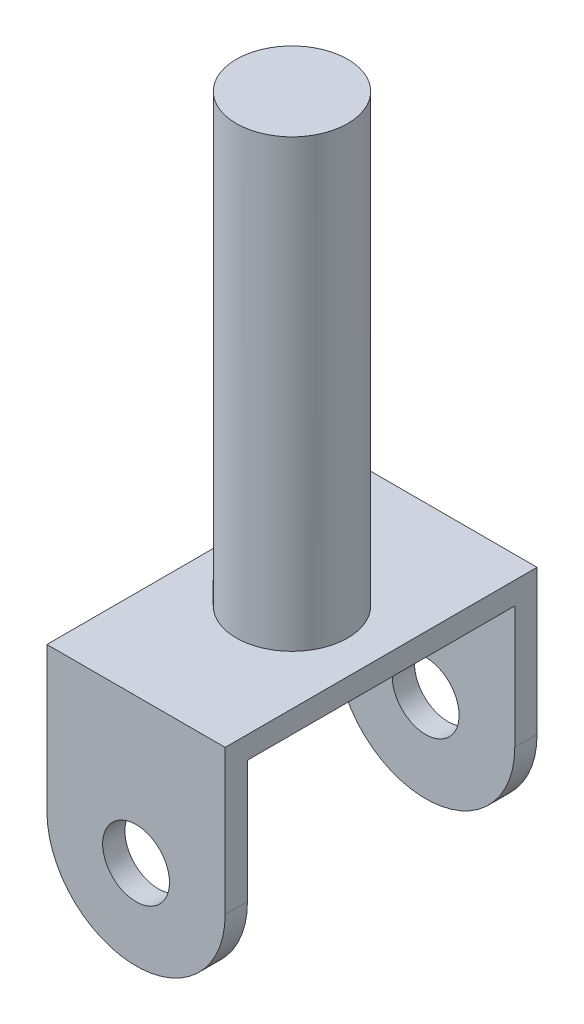
ISO-10303-21;
HEADER;
FILE_DESCRIPTION(('STEP AP214'),'2;1');
FILE_NAME('part.step','',(''),(''),'','','');
FILE_SCHEMA(('AUTOMOTIVE_DESIGN { 1 0 10303 214 1 1 1 1 }'));
ENDSEC;
DATA;
#1=APPLICATION_CONTEXT('core data for automotive mechanical design processes');
#2=APPLICATION_PROTOCOL_DEFINITION('international standard','automotive_design',2000,#1);
#3=PRODUCT_CONTEXT('',#1,'mechanical');
#4=PRODUCT('Part','Part','',(#3));
#5=PRODUCT_RELATED_PRODUCT_CATEGORY('part','',(#4));
#6=PRODUCT_DEFINITION_FORMATION('','',#4);
#7=PRODUCT_DEFINITION_CONTEXT('part definition',#1,'design');
#8=PRODUCT_DEFINITION('design','',#6,#7);
#9=PRODUCT_DEFINITION_SHAPE('','',#8);
#10=(LENGTH_UNIT() NAMED_UNIT(*) SI_UNIT(.MILLI.,.METRE.));
#11=(NAMED_UNIT(*) PLANE_ANGLE_UNIT() SI_UNIT($,.RADIAN.));
#12=(NAMED_UNIT(*) SI_UNIT($,.STERADIAN.) SOLID_ANGLE_UNIT());
#13=UNCERTAINTY_MEASURE_WITH_UNIT(LENGTH_MEASURE(1.E-05),#10,'distance_accuracy_value','');
#14=(GEOMETRIC_REPRESENTATION_CONTEXT(3) GLOBAL_UNCERTAINTY_ASSIGNED_CONTEXT((#13)) GLOBAL_UNIT_ASSIGNED_CONTEXT((#10,
#11,#12)) REPRESENTATION_CONTEXT('',''));
#15=CARTESIAN_POINT('',(0.,0.,0.));
#16=DIRECTION('',(0.,0.,1.));
#17=DIRECTION('',(1.,0.,0.));
#18=AXIS2_PLACEMENT_3D('',#15,#16,#17);
#19=CARTESIAN_POINT('',(4.,3.5,14.));
#20=DIRECTION('',(0.,0.,-1.));
#21=DIRECTION('',(-1.,0.,0.));
#22=AXIS2_PLACEMENT_3D('',#19,#20,#21);
#23=CYLINDRICAL_SURFACE('',#22,4.);
#24=DIRECTION('',(0.,0.,-1.));
#25=VECTOR('',#24,1.);
#26=CARTESIAN_POINT('',(8.,3.5,14.));
#27=LINE('',#26,#25);
#28=CARTESIAN_POINT('',(8.,3.5,1.));
#29=VERTEX_POINT('',#28);
#30=CARTESIAN_POINT('',(8.,3.5,0.));
#31=VERTEX_POINT('',#30);
#32=EDGE_CURVE('E175',#29,#31,#27,.T.);
#33=ORIENTED_EDGE('',*,*,#32,.F.);
#34=CARTESIAN_POINT('',(4.,3.5,1.));
#35=DIRECTION('',(0.,0.,-1.));
#36=DIRECTION('',(-1.,0.,0.));
#37=AXIS2_PLACEMENT_3D('',#34,#35,#36);
#38=CIRCLE('',#37,4.);
#39=CARTESIAN_POINT('',(0.,3.5,1.));
#40=VERTEX_POINT('',#39);
#41=EDGE_CURVE('E141',#29,#40,#38,.T.);
#42=ORIENTED_EDGE('',*,*,#41,.T.);
#43=DIRECTION('',(0.,0.,-1.));
#44=VECTOR('',#43,1.);
#45=CARTESIAN_POINT('',(0.,3.5,14.));
#46=LINE('',#45,#44);
#47=CARTESIAN_POINT('',(0.,3.5,0.));
#48=VERTEX_POINT('',#47);
#49=EDGE_CURVE('E81',#40,#48,#46,.T.);
#50=ORIENTED_EDGE('',*,*,#49,.T.);
#51=CARTESIAN_POINT('',(4.,3.5,0.));
#52=DIRECTION('',(0.,0.,1.));
#53=DIRECTION('',(1.,0.,0.));
#54=AXIS2_PLACEMENT_3D('',#51,#52,#53);
#55=CIRCLE('',#54,4.);
#56=EDGE_CURVE('E151',#48,#31,#55,.T.);
#57=ORIENTED_EDGE('',*,*,#56,.T.);
#58=EDGE_LOOP('',(#33,#42,#50,#57));
#59=FACE_BOUND('',#58,.T.);
#60=ADVANCED_FACE('F33',(#59),#23,.T.);
#61=CARTESIAN_POINT('',(4.,3.5,14.));
#62=DIRECTION('',(0.,0.,-1.));
#63=DIRECTION('',(-1.,0.,0.));
#64=AXIS2_PLACEMENT_3D('',#61,#62,#63);
#65=CYLINDRICAL_SURFACE('',#64,1.5);
#66=CARTESIAN_POINT('',(4.,3.5,1.));
#67=DIRECTION('',(0.,0.,-1.));
#68=DIRECTION('',(-1.,0.,0.));
#69=AXIS2_PLACEMENT_3D('',#66,#67,#68);
#70=CIRCLE('',#69,1.5);
#71=CARTESIAN_POINT('',(2.5,3.5,1.));
#72=VERTEX_POINT('',#71);
#73=EDGE_CURVE('E37',#72,#72,#70,.T.);
#74=ORIENTED_EDGE('',*,*,#73,.F.);
#75=EDGE_LOOP('',(#74));
#76=FACE_BOUND('',#75,.T.);
#77=CARTESIAN_POINT('',(4.,3.5,0.));
#78=DIRECTION('',(0.,0.,1.));
#79=DIRECTION('',(1.,0.,0.));
#80=AXIS2_PLACEMENT_3D('',#77,#78,#79);
#81=CIRCLE('',#80,1.5);
#82=CARTESIAN_POINT('',(5.5,3.5,0.));
#83=VERTEX_POINT('',#82);
#84=EDGE_CURVE('E147',#83,#83,#81,.T.);
#85=ORIENTED_EDGE('',*,*,#84,.F.);
#86=EDGE_LOOP('',(#85));
#87=FACE_BOUND('',#86,.T.);
#88=ADVANCED_FACE('F185',(#76,#87),#65,.F.);
#89=CARTESIAN_POINT('',(0.,10.,14.));
#90=DIRECTION('',(0.,-1.,0.));
#91=DIRECTION('',(0.,0.,-1.));
#92=AXIS2_PLACEMENT_3D('',#89,#90,#91);
#93=PLANE('',#92);
#94=DIRECTION('',(-1.,0.,0.));
#95=VECTOR('',#94,1.);
#96=CARTESIAN_POINT('',(0.,10.,0.));
#97=LINE('',#96,#95);
#98=CARTESIAN_POINT('',(8.,10.,0.));
#99=VERTEX_POINT('',#98);
#100=CARTESIAN_POINT('',(0.,10.,0.));
#101=VERTEX_POINT('',#100);
#102=EDGE_CURVE('E164',#99,#101,#97,.T.);
#103=ORIENTED_EDGE('',*,*,#102,.T.);
#104=DIRECTION('',(0.,0.,-1.));
#105=VECTOR('',#104,1.);
#106=CARTESIAN_POINT('',(0.,10.,14.));
#107=LINE('',#106,#105);
#108=CARTESIAN_POINT('',(0.,10.,14.));
#109=VERTEX_POINT('',#108);
#110=EDGE_CURVE('E169',#109,#101,#107,.T.);
#111=ORIENTED_EDGE('',*,*,#110,.F.);
#112=DIRECTION('',(-1.,0.,0.));
#113=VECTOR('',#112,1.);
#114=CARTESIAN_POINT('',(0.,10.,14.));
#115=LINE('',#114,#113);
#116=CARTESIAN_POINT('',(8.,10.,14.));
#117=VERTEX_POINT('',#116);
#118=EDGE_CURVE('E158',#117,#109,#115,.T.);
#119=ORIENTED_EDGE('',*,*,#118,.F.);
#120=DIRECTION('',(0.,0.,-1.));
#121=VECTOR('',#120,1.);
#122=CARTESIAN_POINT('',(8.,10.,14.));
#123=LINE('',#122,#121);
#124=EDGE_CURVE('E172',#117,#99,#123,.T.);
#125=ORIENTED_EDGE('',*,*,#124,.T.);
#126=EDGE_LOOP('',(#103,#111,#119,#125));
#127=FACE_BOUND('',#126,.T.);
#128=CARTESIAN_POINT('',(4.,10.,7.));
#129=DIRECTION('',(0.,-1.,0.));
#130=DIRECTION('',(0.,0.,-1.));
#131=AXIS2_PLACEMENT_3D('',#128,#129,#130);
#132=CIRCLE('',#131,2.5);
#133=CARTESIAN_POINT('',(4.,10.,4.5));
#134=VERTEX_POINT('',#133);
#135=EDGE_CURVE('E11',#134,#134,#132,.F.);
#136=ORIENTED_EDGE('',*,*,#135,.F.);
#137=EDGE_LOOP('',(#136));
#138=FACE_BOUND('',#137,.T.);
#139=ADVANCED_FACE('F191',(#127,#138),#93,.F.);
#140=CARTESIAN_POINT('',(4.,3.5,14.));
#141=DIRECTION('',(0.,0.,1.));
#142=DIRECTION('',(1.,0.,0.));
#143=AXIS2_PLACEMENT_3D('',#140,#141,#142);
#144=PLANE('',#143);
#145=CARTESIAN_POINT('',(4.,3.5,14.));
#146=DIRECTION('',(0.,0.,1.));
#147=DIRECTION('',(1.,0.,0.));
#148=AXIS2_PLACEMENT_3D('',#145,#146,#147);
#149=CIRCLE('',#148,4.);
#150=CARTESIAN_POINT('',(0.,3.5,14.));
#151=VERTEX_POINT('',#150);
#152=CARTESIAN_POINT('',(8.,3.5,14.));
#153=VERTEX_POINT('',#152);
#154=EDGE_CURVE('E154',#151,#153,#149,.T.);
#155=ORIENTED_EDGE('',*,*,#154,.T.);
#156=DIRECTION('',(0.,1.,0.));
#157=VECTOR('',#156,1.);
#158=CARTESIAN_POINT('',(8.,10.,14.));
#159=LINE('',#158,#157);
#160=EDGE_CURVE('E89',#153,#117,#159,.T.);
#161=ORIENTED_EDGE('',*,*,#160,.T.);
#162=ORIENTED_EDGE('',*,*,#118,.T.);
#163=DIRECTION('',(0.,-1.,0.));
#164=VECTOR('',#163,1.);
#165=CARTESIAN_POINT('',(0.,3.5,14.));
#166=LINE('',#165,#164);
#167=EDGE_CURVE('E59',#109,#151,#166,.T.);
#168=ORIENTED_EDGE('',*,*,#167,.T.);
#169=EDGE_LOOP('',(#155,#161,#162,#168));
#170=FACE_BOUND('',#169,.T.);
#171=CARTESIAN_POINT('',(4.,3.5,14.));
#172=DIRECTION('',(0.,0.,1.));
#173=DIRECTION('',(1.,0.,0.));
#174=AXIS2_PLACEMENT_3D('',#171,#172,#173);
#175=CIRCLE('',#174,1.5);
#176=CARTESIAN_POINT('',(5.5,3.5,14.));
#177=VERTEX_POINT('',#176);
#178=EDGE_CURVE('E148',#177,#177,#175,.T.);
#179=ORIENTED_EDGE('',*,*,#178,.F.);
#180=EDGE_LOOP('',(#179));
#181=FACE_BOUND('',#180,.T.);
#182=ADVANCED_FACE('F188',(#170,#181),#144,.T.);
#183=CARTESIAN_POINT('',(4.,3.5,0.));
#184=DIRECTION('',(0.,0.,1.));
#185=DIRECTION('',(1.,0.,0.));
#186=AXIS2_PLACEMENT_3D('',#183,#184,#185);
#187=PLANE('',#186);
#188=ORIENTED_EDGE('',*,*,#56,.F.);
#189=DIRECTION('',(0.,-1.,0.));
#190=VECTOR('',#189,1.);
#191=CARTESIAN_POINT('',(0.,3.5,0.));
#192=LINE('',#191,#190);
#193=EDGE_CURVE('E156',#101,#48,#192,.T.);
#194=ORIENTED_EDGE('',*,*,#193,.F.);
#195=ORIENTED_EDGE('',*,*,#102,.F.);
#196=DIRECTION('',(0.,1.,0.));
#197=VECTOR('',#196,1.);
#198=CARTESIAN_POINT('',(8.,10.,0.));
#199=LINE('',#198,#197);
#200=EDGE_CURVE('E162',#31,#99,#199,.T.);
#201=ORIENTED_EDGE('',*,*,#200,.F.);
#202=EDGE_LOOP('',(#188,#194,#195,#201));
#203=FACE_BOUND('',#202,.T.);
#204=ORIENTED_EDGE('',*,*,#84,.T.);
#205=EDGE_LOOP('',(#204));
#206=FACE_BOUND('',#205,.T.);
#207=ADVANCED_FACE('F190',(#203,#206),#187,.F.);
#208=CARTESIAN_POINT('',(0.,3.5,13.));
#209=VERTEX_POINT('',#208);
#210=EDGE_CURVE('E167',#151,#209,#46,.T.);
#211=ORIENTED_EDGE('',*,*,#210,.T.);
#212=CARTESIAN_POINT('',(4.,3.5,13.));
#213=DIRECTION('',(0.,0.,1.));
#214=DIRECTION('',(1.,0.,0.));
#215=AXIS2_PLACEMENT_3D('',#212,#213,#214);
#216=CIRCLE('',#215,4.);
#217=CARTESIAN_POINT('',(8.,3.5,13.));
#218=VERTEX_POINT('',#217);
#219=EDGE_CURVE('E50',#209,#218,#216,.T.);
#220=ORIENTED_EDGE('',*,*,#219,.T.);
#221=EDGE_CURVE('E42',#153,#218,#27,.T.);
#222=ORIENTED_EDGE('',*,*,#221,.F.);
#223=ORIENTED_EDGE('',*,*,#154,.F.);
#224=EDGE_LOOP('',(#211,#220,#222,#223));
#225=FACE_BOUND('',#224,.T.);
#226=ADVANCED_FACE('F35',(#225),#23,.T.);
#227=CARTESIAN_POINT('',(8.,10.,14.));
#228=DIRECTION('',(-1.,0.,0.));
#229=DIRECTION('',(0.,0.,1.));
#230=AXIS2_PLACEMENT_3D('',#227,#228,#229);
#231=PLANE('',#230);
#232=DIRECTION('',(0.,0.,-1.));
#233=VECTOR('',#232,1.);
#234=CARTESIAN_POINT('',(8.,9.,14.));
#235=LINE('',#234,#233);
#236=CARTESIAN_POINT('',(8.,9.,13.));
#237=VERTEX_POINT('',#236);
#238=CARTESIAN_POINT('',(8.,9.,1.));
#239=VERTEX_POINT('',#238);
#240=EDGE_CURVE('E119',#237,#239,#235,.T.);
#241=ORIENTED_EDGE('',*,*,#240,.T.);
#242=DIRECTION('',(0.,-1.,0.));
#243=VECTOR('',#242,1.);
#244=CARTESIAN_POINT('',(8.,10.,1.));
#245=LINE('',#244,#243);
#246=EDGE_CURVE('E138',#239,#29,#245,.T.);
#247=ORIENTED_EDGE('',*,*,#246,.T.);
#248=ORIENTED_EDGE('',*,*,#32,.T.);
#249=ORIENTED_EDGE('',*,*,#200,.T.);
#250=ORIENTED_EDGE('',*,*,#124,.F.);
#251=ORIENTED_EDGE('',*,*,#160,.F.);
#252=ORIENTED_EDGE('',*,*,#221,.T.);
#253=DIRECTION('',(0.,1.,0.));
#254=VECTOR('',#253,1.);
#255=CARTESIAN_POINT('',(8.,10.,13.));
#256=LINE('',#255,#254);
#257=EDGE_CURVE('E135',#218,#237,#256,.T.);
#258=ORIENTED_EDGE('',*,*,#257,.T.);
#259=EDGE_LOOP('',(#241,#247,#248,#249,#250,#251,#252,#258));
#260=FACE_BOUND('',#259,.T.);
#261=ADVANCED_FACE('F208',(#260),#231,.F.);
#262=CARTESIAN_POINT('',(0.,3.5,14.));
#263=DIRECTION('',(1.,0.,0.));
#264=DIRECTION('',(0.,0.,-1.));
#265=AXIS2_PLACEMENT_3D('',#262,#263,#264);
#266=PLANE('',#265);
#267=ORIENTED_EDGE('',*,*,#49,.F.);
#268=DIRECTION('',(0.,-1.,0.));
#269=VECTOR('',#268,1.);
#270=CARTESIAN_POINT('',(0.,9.,1.));
#271=LINE('',#270,#269);
#272=CARTESIAN_POINT('',(0.,9.,1.));
#273=VERTEX_POINT('',#272);
#274=EDGE_CURVE('E127',#273,#40,#271,.T.);
#275=ORIENTED_EDGE('',*,*,#274,.F.);
#276=DIRECTION('',(0.,0.,-1.));
#277=VECTOR('',#276,1.);
#278=CARTESIAN_POINT('',(0.,9.,1.));
#279=LINE('',#278,#277);
#280=CARTESIAN_POINT('',(0.,9.,13.));
#281=VERTEX_POINT('',#280);
#282=EDGE_CURVE('E116',#281,#273,#279,.T.);
#283=ORIENTED_EDGE('',*,*,#282,.F.);
#284=DIRECTION('',(0.,1.,0.));
#285=VECTOR('',#284,1.);
#286=CARTESIAN_POINT('',(0.,9.,13.));
#287=LINE('',#286,#285);
#288=EDGE_CURVE('E123',#209,#281,#287,.T.);
#289=ORIENTED_EDGE('',*,*,#288,.F.);
#290=ORIENTED_EDGE('',*,*,#210,.F.);
#291=ORIENTED_EDGE('',*,*,#167,.F.);
#292=ORIENTED_EDGE('',*,*,#110,.T.);
#293=ORIENTED_EDGE('',*,*,#193,.T.);
#294=EDGE_LOOP('',(#267,#275,#283,#289,#290,#291,#292,#293));
#295=FACE_BOUND('',#294,.T.);
#296=ADVANCED_FACE('F129',(#295),#266,.F.);
#297=CARTESIAN_POINT('',(4.,3.5,13.));
#298=DIRECTION('',(0.,0.,1.));
#299=DIRECTION('',(1.,0.,0.));
#300=AXIS2_PLACEMENT_3D('',#297,#298,#299);
#301=CIRCLE('',#300,1.5);
#302=CARTESIAN_POINT('',(5.5,3.5,13.));
#303=VERTEX_POINT('',#302);
#304=EDGE_CURVE('E133',#303,#303,#301,.T.);
#305=ORIENTED_EDGE('',*,*,#304,.F.);
#306=EDGE_LOOP('',(#305));
#307=FACE_BOUND('',#306,.T.);
#308=ORIENTED_EDGE('',*,*,#178,.T.);
#309=EDGE_LOOP('',(#308));
#310=FACE_BOUND('',#309,.T.);
#311=ADVANCED_FACE('F180',(#307,#310),#65,.F.);
#312=CARTESIAN_POINT('',(4.,30.,7.));
#313=DIRECTION('',(0.,-1.,0.));
#314=DIRECTION('',(0.,0.,-1.));
#315=AXIS2_PLACEMENT_3D('',#312,#313,#314);
#316=CYLINDRICAL_SURFACE('',#315,2.5);
#317=CARTESIAN_POINT('',(4.,30.,7.));
#318=DIRECTION('',(0.,1.,0.));
#319=DIRECTION('',(0.,0.,1.));
#320=AXIS2_PLACEMENT_3D('',#317,#318,#319);
#321=CIRCLE('',#320,2.5);
#322=CARTESIAN_POINT('',(4.,30.,9.5));
#323=VERTEX_POINT('',#322);
#324=EDGE_CURVE('E144',#323,#323,#321,.T.);
#325=ORIENTED_EDGE('',*,*,#324,.F.);
#326=EDGE_LOOP('',(#325));
#327=FACE_BOUND('',#326,.T.);
#328=ORIENTED_EDGE('',*,*,#135,.T.);
#329=EDGE_LOOP('',(#328));
#330=FACE_BOUND('',#329,.T.);
#331=ADVANCED_FACE('F183',(#327,#330),#316,.T.);
#332=CARTESIAN_POINT('',(4.,30.,7.));
#333=DIRECTION('',(0.,1.,0.));
#334=DIRECTION('',(0.,0.,1.));
#335=AXIS2_PLACEMENT_3D('',#332,#333,#334);
#336=PLANE('',#335);
#337=ORIENTED_EDGE('',*,*,#324,.T.);
#338=EDGE_LOOP('',(#337));
#339=FACE_BOUND('',#338,.T.);
#340=ADVANCED_FACE('F232',(#339),#336,.T.);
#341=CARTESIAN_POINT('',(20.,9.,1.));
#342=DIRECTION('',(0.,1.,0.));
#343=DIRECTION('',(0.,0.,1.));
#344=AXIS2_PLACEMENT_3D('',#341,#342,#343);
#345=PLANE('',#344);
#346=DIRECTION('',(-1.,0.,0.));
#347=VECTOR('',#346,1.);
#348=CARTESIAN_POINT('',(20.,9.,13.));
#349=LINE('',#348,#347);
#350=EDGE_CURVE('E112',#237,#281,#349,.T.);
#351=ORIENTED_EDGE('',*,*,#350,.T.);
#352=ORIENTED_EDGE('',*,*,#282,.T.);
#353=DIRECTION('',(-1.,0.,0.));
#354=VECTOR('',#353,1.);
#355=CARTESIAN_POINT('',(20.,9.,1.));
#356=LINE('',#355,#354);
#357=EDGE_CURVE('E121',#239,#273,#356,.T.);
#358=ORIENTED_EDGE('',*,*,#357,.F.);
#359=ORIENTED_EDGE('',*,*,#240,.F.);
#360=EDGE_LOOP('',(#351,#352,#358,#359));
#361=FACE_BOUND('',#360,.T.);
#362=ADVANCED_FACE('F113',(#361),#345,.F.);
#363=CARTESIAN_POINT('',(20.,9.,1.));
#364=DIRECTION('',(0.,0.,-1.));
#365=DIRECTION('',(-1.,0.,0.));
#366=AXIS2_PLACEMENT_3D('',#363,#364,#365);
#367=PLANE('',#366);
#368=ORIENTED_EDGE('',*,*,#73,.T.);
#369=EDGE_LOOP('',(#368));
#370=FACE_BOUND('',#369,.T.);
#371=ORIENTED_EDGE('',*,*,#246,.F.);
#372=ORIENTED_EDGE('',*,*,#357,.T.);
#373=ORIENTED_EDGE('',*,*,#274,.T.);
#374=ORIENTED_EDGE('',*,*,#41,.F.);
#375=EDGE_LOOP('',(#371,#372,#373,#374));
#376=FACE_BOUND('',#375,.T.);
#377=ADVANCED_FACE('F223',(#370,#376),#367,.F.);
#378=CARTESIAN_POINT('',(20.,9.,13.));
#379=DIRECTION('',(0.,0.,1.));
#380=DIRECTION('',(1.,0.,0.));
#381=AXIS2_PLACEMENT_3D('',#378,#379,#380);
#382=PLANE('',#381);
#383=ORIENTED_EDGE('',*,*,#304,.T.);
#384=EDGE_LOOP('',(#383));
#385=FACE_BOUND('',#384,.T.);
#386=ORIENTED_EDGE('',*,*,#288,.T.);
#387=ORIENTED_EDGE('',*,*,#350,.F.);
#388=ORIENTED_EDGE('',*,*,#257,.F.);
#389=ORIENTED_EDGE('',*,*,#219,.F.);
#390=EDGE_LOOP('',(#386,#387,#388,#389));
#391=FACE_BOUND('',#390,.T.);
#392=ADVANCED_FACE('F124',(#385,#391),#382,.F.);
#393=CLOSED_SHELL('',(#60,#88,#139,#182,#207,#226,#261,#296,#311,#331,#340,#362,#377,#392));
#394=MANIFOLD_SOLID_BREP('B2',#393);
#395=ADVANCED_BREP_SHAPE_REPRESENTATION('',(#18,#394),#14);
#396=SHAPE_DEFINITION_REPRESENTATION(#9,#395);
ENDSEC;
END-ISO-10303-21;
